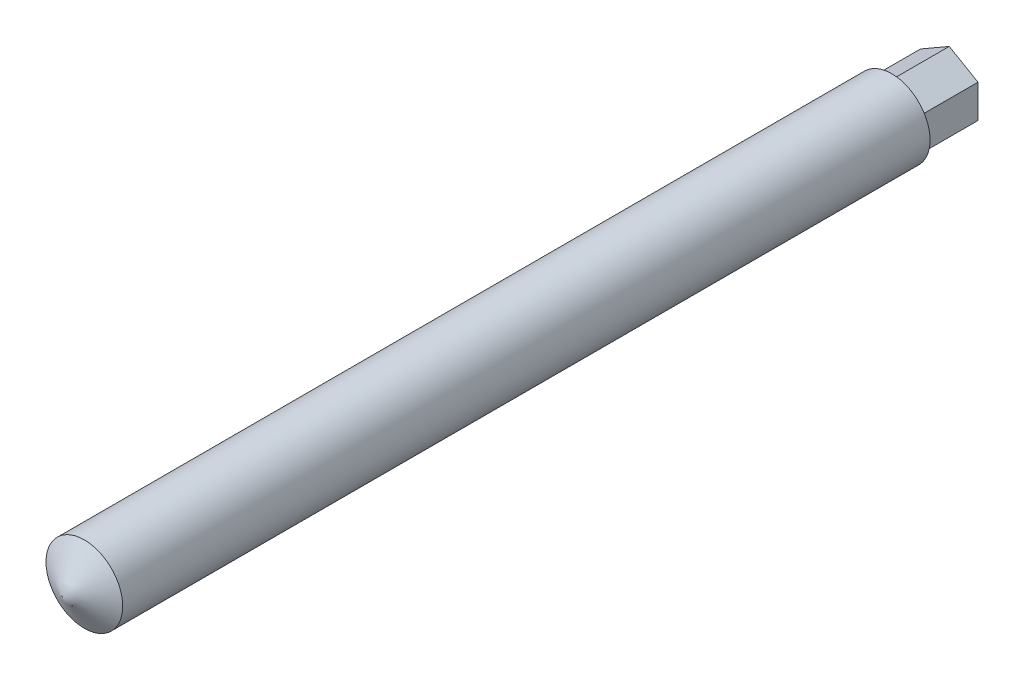
ISO-10303-21;
HEADER;
FILE_DESCRIPTION(('STEP AP214'),'2;1');
FILE_NAME('part.step','',(''),(''),'','','');
FILE_SCHEMA(('AUTOMOTIVE_DESIGN { 1 0 10303 214 1 1 1 1 }'));
ENDSEC;
DATA;
#1=APPLICATION_CONTEXT('core data for automotive mechanical design processes');
#2=APPLICATION_PROTOCOL_DEFINITION('international standard','automotive_design',2000,#1);
#3=PRODUCT_CONTEXT('',#1,'mechanical');
#4=PRODUCT('Part','Part','',(#3));
#5=PRODUCT_RELATED_PRODUCT_CATEGORY('part','',(#4));
#6=PRODUCT_DEFINITION_FORMATION('','',#4);
#7=PRODUCT_DEFINITION_CONTEXT('part definition',#1,'design');
#8=PRODUCT_DEFINITION('design','',#6,#7);
#9=PRODUCT_DEFINITION_SHAPE('','',#8);
#10=(LENGTH_UNIT() NAMED_UNIT(*) SI_UNIT(.MILLI.,.METRE.));
#11=(NAMED_UNIT(*) PLANE_ANGLE_UNIT() SI_UNIT($,.RADIAN.));
#12=(NAMED_UNIT(*) SI_UNIT($,.STERADIAN.) SOLID_ANGLE_UNIT());
#13=UNCERTAINTY_MEASURE_WITH_UNIT(LENGTH_MEASURE(1.E-05),#10,'distance_accuracy_value','');
#14=(GEOMETRIC_REPRESENTATION_CONTEXT(3) GLOBAL_UNCERTAINTY_ASSIGNED_CONTEXT((#13)) GLOBAL_UNIT_ASSIGNED_CONTEXT((#10,
#11,#12)) REPRESENTATION_CONTEXT('',''));
#15=CARTESIAN_POINT('',(0.,0.,0.));
#16=DIRECTION('',(0.,0.,1.));
#17=DIRECTION('',(1.,0.,0.));
#18=AXIS2_PLACEMENT_3D('',#15,#16,#17);
#19=CARTESIAN_POINT('',(0.,0.,-40.));
#20=DIRECTION('',(0.,0.,1.));
#21=DIRECTION('',(1.,0.,0.));
#22=AXIS2_PLACEMENT_3D('',#19,#20,#21);
#23=PLANE('',#22);
#24=CARTESIAN_POINT('',(0.,0.,-40.));
#25=DIRECTION('',(0.,0.,1.));
#26=DIRECTION('',(1.,0.,0.));
#27=AXIS2_PLACEMENT_3D('',#24,#25,#26);
#28=CIRCLE('',#27,10.);
#29=CARTESIAN_POINT('',(10.,0.,-40.));
#30=VERTEX_POINT('',#29);
#31=EDGE_CURVE('E11',#30,#30,#28,.T.);
#32=ORIENTED_EDGE('',*,*,#31,.F.);
#33=EDGE_LOOP('',(#32));
#34=FACE_BOUND('',#33,.T.);
#35=DIRECTION('',(0.866025403784439,0.5,0.));
#36=VECTOR('',#35,1.);
#37=CARTESIAN_POINT('',(-7.5,4.33012701892219,-40.));
#38=LINE('',#37,#36);
#39=CARTESIAN_POINT('',(-7.5,4.33012701892219,-40.));
#40=VERTEX_POINT('',#39);
#41=CARTESIAN_POINT('',(0.,8.66025403784438,-40.));
#42=VERTEX_POINT('',#41);
#43=EDGE_CURVE('E53',#40,#42,#38,.T.);
#44=ORIENTED_EDGE('',*,*,#43,.F.);
#45=DIRECTION('',(0.,1.,0.));
#46=VECTOR('',#45,1.);
#47=CARTESIAN_POINT('',(-7.5,-4.33012701892219,-40.));
#48=LINE('',#47,#46);
#49=CARTESIAN_POINT('',(-7.5,-4.33012701892219,-40.));
#50=VERTEX_POINT('',#49);
#51=EDGE_CURVE('E57',#50,#40,#48,.T.);
#52=ORIENTED_EDGE('',*,*,#51,.F.);
#53=DIRECTION('',(-0.866025403784439,0.5,0.));
#54=VECTOR('',#53,1.);
#55=CARTESIAN_POINT('',(0.,-8.66025403784439,-40.));
#56=LINE('',#55,#54);
#57=CARTESIAN_POINT('',(0.,-8.66025403784439,-40.));
#58=VERTEX_POINT('',#57);
#59=EDGE_CURVE('E130',#58,#50,#56,.T.);
#60=ORIENTED_EDGE('',*,*,#59,.F.);
#61=DIRECTION('',(-0.866025403784439,-0.5,0.));
#62=VECTOR('',#61,1.);
#63=CARTESIAN_POINT('',(7.5,-4.33012701892219,-40.));
#64=LINE('',#63,#62);
#65=CARTESIAN_POINT('',(7.5,-4.33012701892219,-40.));
#66=VERTEX_POINT('',#65);
#67=EDGE_CURVE('E132',#66,#58,#64,.T.);
#68=ORIENTED_EDGE('',*,*,#67,.F.);
#69=DIRECTION('',(0.,-1.,0.));
#70=VECTOR('',#69,1.);
#71=CARTESIAN_POINT('',(7.5,4.33012701892219,-40.));
#72=LINE('',#71,#70);
#73=CARTESIAN_POINT('',(7.5,4.33012701892219,-40.));
#74=VERTEX_POINT('',#73);
#75=EDGE_CURVE('E135',#74,#66,#72,.T.);
#76=ORIENTED_EDGE('',*,*,#75,.F.);
#77=DIRECTION('',(0.866025403784439,-0.5,0.));
#78=VECTOR('',#77,1.);
#79=CARTESIAN_POINT('',(0.,8.66025403784438,-40.));
#80=LINE('',#79,#78);
#81=EDGE_CURVE('E138',#42,#74,#80,.T.);
#82=ORIENTED_EDGE('',*,*,#81,.F.);
#83=EDGE_LOOP('',(#44,#52,#60,#68,#76,#82));
#84=FACE_BOUND('',#83,.T.);
#85=ADVANCED_FACE('F38',(#34,#84),#23,.F.);
#86=CARTESIAN_POINT('',(0.,0.,170.57735026919));
#87=DIRECTION('',(0.,0.,-1.));
#88=DIRECTION('',(-1.,0.,0.));
#89=AXIS2_PLACEMENT_3D('',#86,#87,#88);
#90=CONICAL_SURFACE('',#89,9.99999999999998,1.04719755119659);
#91=CARTESIAN_POINT('',(0.,0.,176.350852961086));
#92=VERTEX_POINT('',#91);
#93=VERTEX_LOOP('',#92);
#94=FACE_BOUND('',#93,.T.);
#95=CARTESIAN_POINT('',(0.,0.,170.57735026919));
#96=DIRECTION('',(0.,0.,1.));
#97=DIRECTION('',(1.,0.,0.));
#98=AXIS2_PLACEMENT_3D('',#95,#96,#97);
#99=CIRCLE('',#98,9.99999999999998);
#100=CARTESIAN_POINT('',(9.99999999999998,0.,170.57735026919));
#101=VERTEX_POINT('',#100);
#102=EDGE_CURVE('E46',#101,#101,#99,.T.);
#103=ORIENTED_EDGE('',*,*,#102,.T.);
#104=EDGE_LOOP('',(#103));
#105=FACE_BOUND('',#104,.T.);
#106=ADVANCED_FACE('F40',(#94,#105),#90,.T.);
#107=CARTESIAN_POINT('',(0.,0.,756.580802456284));
#108=DIRECTION('',(0.,0.,1.));
#109=DIRECTION('',(1.,0.,0.));
#110=AXIS2_PLACEMENT_3D('',#107,#108,#109);
#111=CYLINDRICAL_SURFACE('',#110,9.99999999999999);
#112=ORIENTED_EDGE('',*,*,#102,.F.);
#113=EDGE_LOOP('',(#112));
#114=FACE_BOUND('',#113,.T.);
#115=ORIENTED_EDGE('',*,*,#31,.T.);
#116=EDGE_LOOP('',(#115));
#117=FACE_BOUND('',#116,.T.);
#118=ADVANCED_FACE('F172',(#114,#117),#111,.T.);
#119=CARTESIAN_POINT('',(-7.5,4.33012701892219,-55.));
#120=DIRECTION('',(0.5,-0.866025403784439,0.));
#121=DIRECTION('',(0.866025403784439,0.5,0.));
#122=AXIS2_PLACEMENT_3D('',#119,#120,#121);
#123=PLANE('',#122);
#124=ORIENTED_EDGE('',*,*,#43,.T.);
#125=DIRECTION('',(0.,0.,1.));
#126=VECTOR('',#125,1.);
#127=CARTESIAN_POINT('',(0.,8.66025403784438,-55.));
#128=LINE('',#127,#126);
#129=CARTESIAN_POINT('',(0.,8.66025403784438,-55.));
#130=VERTEX_POINT('',#129);
#131=EDGE_CURVE('E97',#130,#42,#128,.T.);
#132=ORIENTED_EDGE('',*,*,#131,.F.);
#133=DIRECTION('',(0.866025403784439,0.5,0.));
#134=VECTOR('',#133,1.);
#135=CARTESIAN_POINT('',(-7.5,4.33012701892219,-55.));
#136=LINE('',#135,#134);
#137=CARTESIAN_POINT('',(-7.5,4.33012701892219,-55.));
#138=VERTEX_POINT('',#137);
#139=EDGE_CURVE('E103',#138,#130,#136,.T.);
#140=ORIENTED_EDGE('',*,*,#139,.F.);
#141=DIRECTION('',(0.,0.,1.));
#142=VECTOR('',#141,1.);
#143=CARTESIAN_POINT('',(-7.5,4.33012701892219,-55.));
#144=LINE('',#143,#142);
#145=EDGE_CURVE('E127',#138,#40,#144,.T.);
#146=ORIENTED_EDGE('',*,*,#145,.T.);
#147=EDGE_LOOP('',(#124,#132,#140,#146));
#148=FACE_BOUND('',#147,.T.);
#149=ADVANCED_FACE('F113',(#148),#123,.F.);
#150=CARTESIAN_POINT('',(0.,8.66025403784438,-55.));
#151=DIRECTION('',(-0.5,-0.866025403784439,0.));
#152=DIRECTION('',(0.866025403784439,-0.5,0.));
#153=AXIS2_PLACEMENT_3D('',#150,#151,#152);
#154=PLANE('',#153);
#155=ORIENTED_EDGE('',*,*,#81,.T.);
#156=DIRECTION('',(0.,0.,1.));
#157=VECTOR('',#156,1.);
#158=CARTESIAN_POINT('',(7.5,4.33012701892219,-55.));
#159=LINE('',#158,#157);
#160=CARTESIAN_POINT('',(7.5,4.33012701892219,-55.));
#161=VERTEX_POINT('',#160);
#162=EDGE_CURVE('E99',#161,#74,#159,.T.);
#163=ORIENTED_EDGE('',*,*,#162,.F.);
#164=DIRECTION('',(0.866025403784439,-0.5,0.));
#165=VECTOR('',#164,1.);
#166=CARTESIAN_POINT('',(0.,8.66025403784438,-55.));
#167=LINE('',#166,#165);
#168=EDGE_CURVE('E92',#130,#161,#167,.T.);
#169=ORIENTED_EDGE('',*,*,#168,.F.);
#170=ORIENTED_EDGE('',*,*,#131,.T.);
#171=EDGE_LOOP('',(#155,#163,#169,#170));
#172=FACE_BOUND('',#171,.T.);
#173=ADVANCED_FACE('F95',(#172),#154,.F.);
#174=CARTESIAN_POINT('',(7.5,4.33012701892219,-55.));
#175=DIRECTION('',(-1.,0.,0.));
#176=DIRECTION('',(0.,0.,1.));
#177=AXIS2_PLACEMENT_3D('',#174,#175,#176);
#178=PLANE('',#177);
#179=ORIENTED_EDGE('',*,*,#75,.T.);
#180=DIRECTION('',(0.,0.,1.));
#181=VECTOR('',#180,1.);
#182=CARTESIAN_POINT('',(7.5,-4.33012701892219,-55.));
#183=LINE('',#182,#181);
#184=CARTESIAN_POINT('',(7.5,-4.33012701892219,-55.));
#185=VERTEX_POINT('',#184);
#186=EDGE_CURVE('E116',#185,#66,#183,.T.);
#187=ORIENTED_EDGE('',*,*,#186,.F.);
#188=DIRECTION('',(0.,-1.,0.));
#189=VECTOR('',#188,1.);
#190=CARTESIAN_POINT('',(7.5,4.33012701892219,-55.));
#191=LINE('',#190,#189);
#192=EDGE_CURVE('E102',#161,#185,#191,.T.);
#193=ORIENTED_EDGE('',*,*,#192,.F.);
#194=ORIENTED_EDGE('',*,*,#162,.T.);
#195=EDGE_LOOP('',(#179,#187,#193,#194));
#196=FACE_BOUND('',#195,.T.);
#197=ADVANCED_FACE('F150',(#196),#178,.F.);
#198=CARTESIAN_POINT('',(7.5,-4.33012701892219,-55.));
#199=DIRECTION('',(-0.5,0.866025403784438,0.));
#200=DIRECTION('',(-0.866025403784439,-0.5,0.));
#201=AXIS2_PLACEMENT_3D('',#198,#199,#200);
#202=PLANE('',#201);
#203=ORIENTED_EDGE('',*,*,#67,.T.);
#204=DIRECTION('',(0.,0.,1.));
#205=VECTOR('',#204,1.);
#206=CARTESIAN_POINT('',(0.,-8.66025403784439,-55.));
#207=LINE('',#206,#205);
#208=CARTESIAN_POINT('',(0.,-8.66025403784439,-55.));
#209=VERTEX_POINT('',#208);
#210=EDGE_CURVE('E121',#209,#58,#207,.T.);
#211=ORIENTED_EDGE('',*,*,#210,.F.);
#212=DIRECTION('',(-0.866025403784439,-0.5,0.));
#213=VECTOR('',#212,1.);
#214=CARTESIAN_POINT('',(7.5,-4.33012701892219,-55.));
#215=LINE('',#214,#213);
#216=EDGE_CURVE('E144',#185,#209,#215,.T.);
#217=ORIENTED_EDGE('',*,*,#216,.F.);
#218=ORIENTED_EDGE('',*,*,#186,.T.);
#219=EDGE_LOOP('',(#203,#211,#217,#218));
#220=FACE_BOUND('',#219,.T.);
#221=ADVANCED_FACE('F152',(#220),#202,.F.);
#222=CARTESIAN_POINT('',(0.,-8.66025403784439,-55.));
#223=DIRECTION('',(0.5,0.866025403784439,0.));
#224=DIRECTION('',(-0.866025403784439,0.5,0.));
#225=AXIS2_PLACEMENT_3D('',#222,#223,#224);
#226=PLANE('',#225);
#227=ORIENTED_EDGE('',*,*,#59,.T.);
#228=DIRECTION('',(0.,0.,1.));
#229=VECTOR('',#228,1.);
#230=CARTESIAN_POINT('',(-7.5,-4.33012701892219,-55.));
#231=LINE('',#230,#229);
#232=CARTESIAN_POINT('',(-7.5,-4.33012701892219,-55.));
#233=VERTEX_POINT('',#232);
#234=EDGE_CURVE('E124',#233,#50,#231,.T.);
#235=ORIENTED_EDGE('',*,*,#234,.F.);
#236=DIRECTION('',(-0.866025403784439,0.5,0.));
#237=VECTOR('',#236,1.);
#238=CARTESIAN_POINT('',(0.,-8.66025403784439,-55.));
#239=LINE('',#238,#237);
#240=EDGE_CURVE('E142',#209,#233,#239,.T.);
#241=ORIENTED_EDGE('',*,*,#240,.F.);
#242=ORIENTED_EDGE('',*,*,#210,.T.);
#243=EDGE_LOOP('',(#227,#235,#241,#242));
#244=FACE_BOUND('',#243,.T.);
#245=ADVANCED_FACE('F156',(#244),#226,.F.);
#246=CARTESIAN_POINT('',(-7.5,-4.33012701892219,-55.));
#247=DIRECTION('',(1.,0.,0.));
#248=DIRECTION('',(0.,1.,0.));
#249=AXIS2_PLACEMENT_3D('',#246,#247,#248);
#250=PLANE('',#249);
#251=ORIENTED_EDGE('',*,*,#51,.T.);
#252=ORIENTED_EDGE('',*,*,#145,.F.);
#253=DIRECTION('',(0.,1.,0.));
#254=VECTOR('',#253,1.);
#255=CARTESIAN_POINT('',(-7.5,-4.33012701892219,-55.));
#256=LINE('',#255,#254);
#257=EDGE_CURVE('E108',#233,#138,#256,.T.);
#258=ORIENTED_EDGE('',*,*,#257,.F.);
#259=ORIENTED_EDGE('',*,*,#234,.T.);
#260=EDGE_LOOP('',(#251,#252,#258,#259));
#261=FACE_BOUND('',#260,.T.);
#262=ADVANCED_FACE('F158',(#261),#250,.F.);
#263=CARTESIAN_POINT('',(0.,0.,-55.));
#264=DIRECTION('',(0.,0.,-1.));
#265=DIRECTION('',(-1.,0.,0.));
#266=AXIS2_PLACEMENT_3D('',#263,#264,#265);
#267=PLANE('',#266);
#268=ORIENTED_EDGE('',*,*,#139,.T.);
#269=ORIENTED_EDGE('',*,*,#168,.T.);
#270=ORIENTED_EDGE('',*,*,#192,.T.);
#271=ORIENTED_EDGE('',*,*,#216,.T.);
#272=ORIENTED_EDGE('',*,*,#240,.T.);
#273=ORIENTED_EDGE('',*,*,#257,.T.);
#274=EDGE_LOOP('',(#268,#269,#270,#271,#272,#273));
#275=FACE_BOUND('',#274,.T.);
#276=ADVANCED_FACE('F106',(#275),#267,.T.);
#277=CLOSED_SHELL('',(#85,#106,#118,#149,#173,#197,#221,#245,#262,#276));
#278=MANIFOLD_SOLID_BREP('B2',#277);
#279=ADVANCED_BREP_SHAPE_REPRESENTATION('',(#18,#278),#14);
#280=SHAPE_DEFINITION_REPRESENTATION(#9,#279);
ENDSEC;
END-ISO-10303-21;
